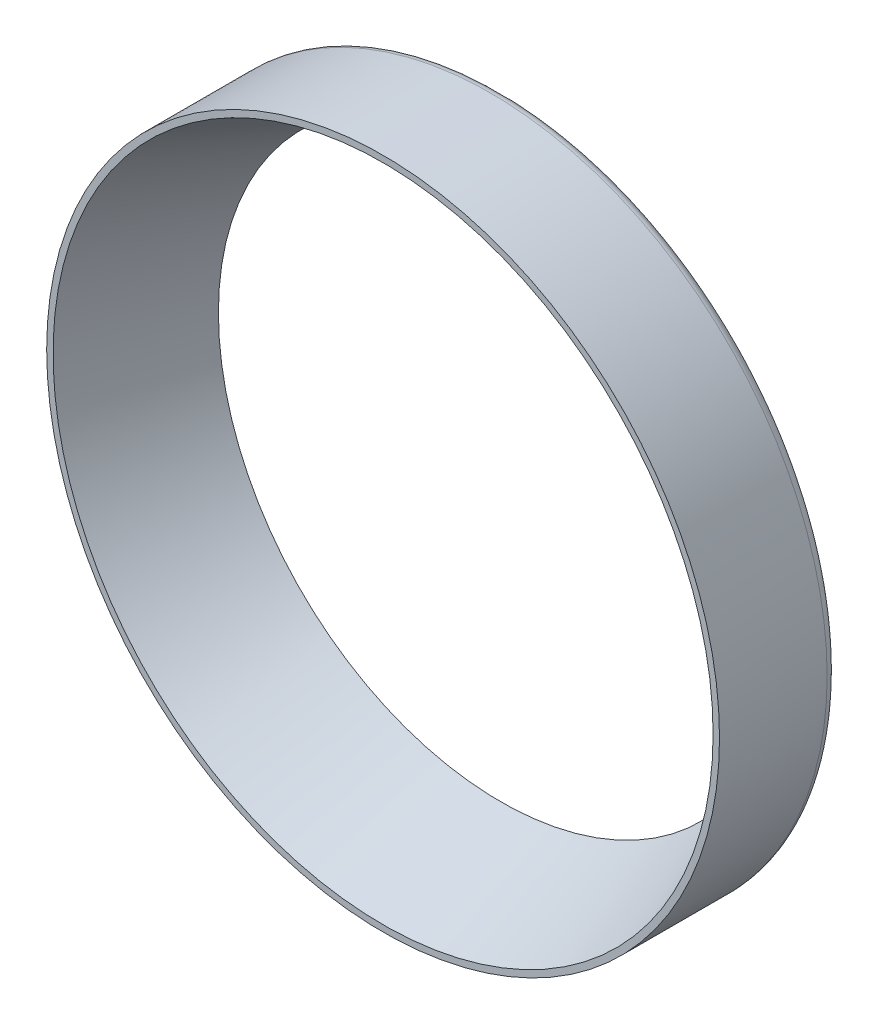
ISO-10303-21;
HEADER;
FILE_DESCRIPTION(('STEP AP214'),'2;1');
FILE_NAME('part.step','',(''),(''),'','','');
FILE_SCHEMA(('AUTOMOTIVE_DESIGN { 1 0 10303 214 1 1 1 1 }'));
ENDSEC;
DATA;
#1=APPLICATION_CONTEXT('core data for automotive mechanical design processes');
#2=APPLICATION_PROTOCOL_DEFINITION('international standard','automotive_design',2000,#1);
#3=PRODUCT_CONTEXT('',#1,'mechanical');
#4=PRODUCT('Part','Part','',(#3));
#5=PRODUCT_RELATED_PRODUCT_CATEGORY('part','',(#4));
#6=PRODUCT_DEFINITION_FORMATION('','',#4);
#7=PRODUCT_DEFINITION_CONTEXT('part definition',#1,'design');
#8=PRODUCT_DEFINITION('design','',#6,#7);
#9=PRODUCT_DEFINITION_SHAPE('','',#8);
#10=(LENGTH_UNIT() NAMED_UNIT(*) SI_UNIT(.MILLI.,.METRE.));
#11=(NAMED_UNIT(*) PLANE_ANGLE_UNIT() SI_UNIT($,.RADIAN.));
#12=(NAMED_UNIT(*) SI_UNIT($,.STERADIAN.) SOLID_ANGLE_UNIT());
#13=UNCERTAINTY_MEASURE_WITH_UNIT(LENGTH_MEASURE(1.E-05),#10,'distance_accuracy_value','');
#14=(GEOMETRIC_REPRESENTATION_CONTEXT(3) GLOBAL_UNCERTAINTY_ASSIGNED_CONTEXT((#13)) GLOBAL_UNIT_ASSIGNED_CONTEXT((#10,
#11,#12)) REPRESENTATION_CONTEXT('',''));
#15=CARTESIAN_POINT('',(0.,0.,0.));
#16=DIRECTION('',(0.,0.,1.));
#17=DIRECTION('',(1.,0.,0.));
#18=AXIS2_PLACEMENT_3D('',#15,#16,#17);
#19=CARTESIAN_POINT('',(0.,0.,12.9431522713255));
#20=DIRECTION('',(0.,0.,1.));
#21=DIRECTION('',(1.,0.,0.));
#22=AXIS2_PLACEMENT_3D('',#19,#20,#21);
#23=CONICAL_SURFACE('',#22,47.206703209703,0.383972435438753);
#24=CARTESIAN_POINT('',(0.,0.,17.5));
#25=DIRECTION('',(0.,0.,-1.));
#26=DIRECTION('',(1.,0.,0.));
#27=AXIS2_PLACEMENT_3D('',#24,#25,#26);
#28=CIRCLE('',#27,49.0477891992249);
#29=CARTESIAN_POINT('',(49.0477891992249,1.10125371528497E-12,17.5));
#30=VERTEX_POINT('',#29);
#31=EDGE_CURVE('E11',#30,#30,#28,.T.);
#32=ORIENTED_EDGE('',*,*,#31,.F.);
#33=EDGE_LOOP('',(#32));
#34=FACE_BOUND('',#33,.T.);
#35=CARTESIAN_POINT('',(0.,0.,0.));
#36=DIRECTION('',(0.,0.,-1.));
#37=DIRECTION('',(1.,0.,0.));
#38=AXIS2_PLACEMENT_3D('',#35,#36,#37);
#39=CIRCLE('',#38,41.9773302471096);
#40=CARTESIAN_POINT('',(41.9773302471096,9.43187267300066E-13,0.));
#41=VERTEX_POINT('',#40);
#42=EDGE_CURVE('E26',#41,#41,#39,.T.);
#43=ORIENTED_EDGE('',*,*,#42,.T.);
#44=EDGE_LOOP('',(#43));
#45=FACE_BOUND('',#44,.T.);
#46=ADVANCED_FACE('F17',(#34,#45),#23,.F.);
#47=CARTESIAN_POINT('',(49.5238945996124,1.11189747830167E-12,17.5));
#48=DIRECTION('',(0.,0.,1.));
#49=DIRECTION('',(1.,0.,0.));
#50=AXIS2_PLACEMENT_3D('',#47,#48,#49);
#51=PLANE('',#50);
#52=ORIENTED_EDGE('',*,*,#31,.T.);
#53=EDGE_LOOP('',(#52));
#54=FACE_BOUND('',#53,.T.);
#55=CARTESIAN_POINT('',(0.,0.,17.5));
#56=DIRECTION('',(0.,0.,-1.));
#57=DIRECTION('',(1.,0.,0.));
#58=AXIS2_PLACEMENT_3D('',#55,#56,#57);
#59=CIRCLE('',#58,50.);
#60=CARTESIAN_POINT('',(50.,1.12254124131839E-12,17.5));
#61=VERTEX_POINT('',#60);
#62=EDGE_CURVE('E20',#61,#61,#59,.T.);
#63=ORIENTED_EDGE('',*,*,#62,.F.);
#64=EDGE_LOOP('',(#63));
#65=FACE_BOUND('',#64,.T.);
#66=ADVANCED_FACE('F78',(#54,#65),#51,.T.);
#67=CARTESIAN_POINT('',(45.9886651235548,1.03286425430922E-12,0.));
#68=DIRECTION('',(0.,0.,-1.));
#69=DIRECTION('',(0.,-1.,0.));
#70=AXIS2_PLACEMENT_3D('',#67,#68,#69);
#71=PLANE('',#70);
#72=ORIENTED_EDGE('',*,*,#42,.F.);
#73=EDGE_LOOP('',(#72));
#74=FACE_BOUND('',#73,.T.);
#75=CARTESIAN_POINT('',(0.,0.,0.));
#76=DIRECTION('',(0.,0.,1.));
#77=DIRECTION('',(-1.,0.,0.));
#78=AXIS2_PLACEMENT_3D('',#75,#76,#77);
#79=CIRCLE('',#78,48.5);
#80=CARTESIAN_POINT('',(-48.5,-1.0854540931605E-12,0.));
#81=VERTEX_POINT('',#80);
#82=EDGE_CURVE('E60',#81,#81,#79,.T.);
#83=ORIENTED_EDGE('',*,*,#82,.F.);
#84=EDGE_LOOP('',(#83));
#85=FACE_BOUND('',#84,.T.);
#86=ADVANCED_FACE('F80',(#74,#85),#71,.T.);
#87=CARTESIAN_POINT('',(0.,0.,8.75));
#88=DIRECTION('',(0.,0.,-1.));
#89=DIRECTION('',(1.,0.,0.));
#90=AXIS2_PLACEMENT_3D('',#87,#88,#89);
#91=CYLINDRICAL_SURFACE('',#90,50.);
#92=ORIENTED_EDGE('',*,*,#62,.T.);
#93=EDGE_LOOP('',(#92));
#94=FACE_BOUND('',#93,.T.);
#95=CARTESIAN_POINT('',(0.,0.,1.5));
#96=DIRECTION('',(0.,0.,-1.));
#97=DIRECTION('',(-1.,0.,0.));
#98=AXIS2_PLACEMENT_3D('',#95,#96,#97);
#99=CIRCLE('',#98,50.);
#100=CARTESIAN_POINT('',(-50.,-1.1191716348124E-12,1.5));
#101=VERTEX_POINT('',#100);
#102=EDGE_CURVE('E53',#101,#101,#99,.T.);
#103=ORIENTED_EDGE('',*,*,#102,.F.);
#104=EDGE_LOOP('',(#103));
#105=FACE_BOUND('',#104,.T.);
#106=ADVANCED_FACE('F75',(#94,#105),#91,.T.);
#107=CARTESIAN_POINT('',(0.,0.,1.5));
#108=DIRECTION('',(0.,0.,-1.));
#109=DIRECTION('',(0.,1.,0.));
#110=AXIS2_PLACEMENT_3D('',#107,#108,#109);
#111=TOROIDAL_SURFACE('',#110,48.5,1.5);
#112=ORIENTED_EDGE('',*,*,#102,.T.);
#113=EDGE_LOOP('',(#112));
#114=FACE_BOUND('',#113,.T.);
#115=ORIENTED_EDGE('',*,*,#82,.T.);
#116=EDGE_LOOP('',(#115));
#117=FACE_BOUND('',#116,.T.);
#118=ADVANCED_FACE('F61',(#114,#117),#111,.T.);
#119=CLOSED_SHELL('',(#46,#66,#86,#106,#118));
#120=MANIFOLD_SOLID_BREP('B1',#119);
#121=ADVANCED_BREP_SHAPE_REPRESENTATION('',(#18,#120),#14);
#122=SHAPE_DEFINITION_REPRESENTATION(#9,#121);
ENDSEC;
END-ISO-10303-21;
